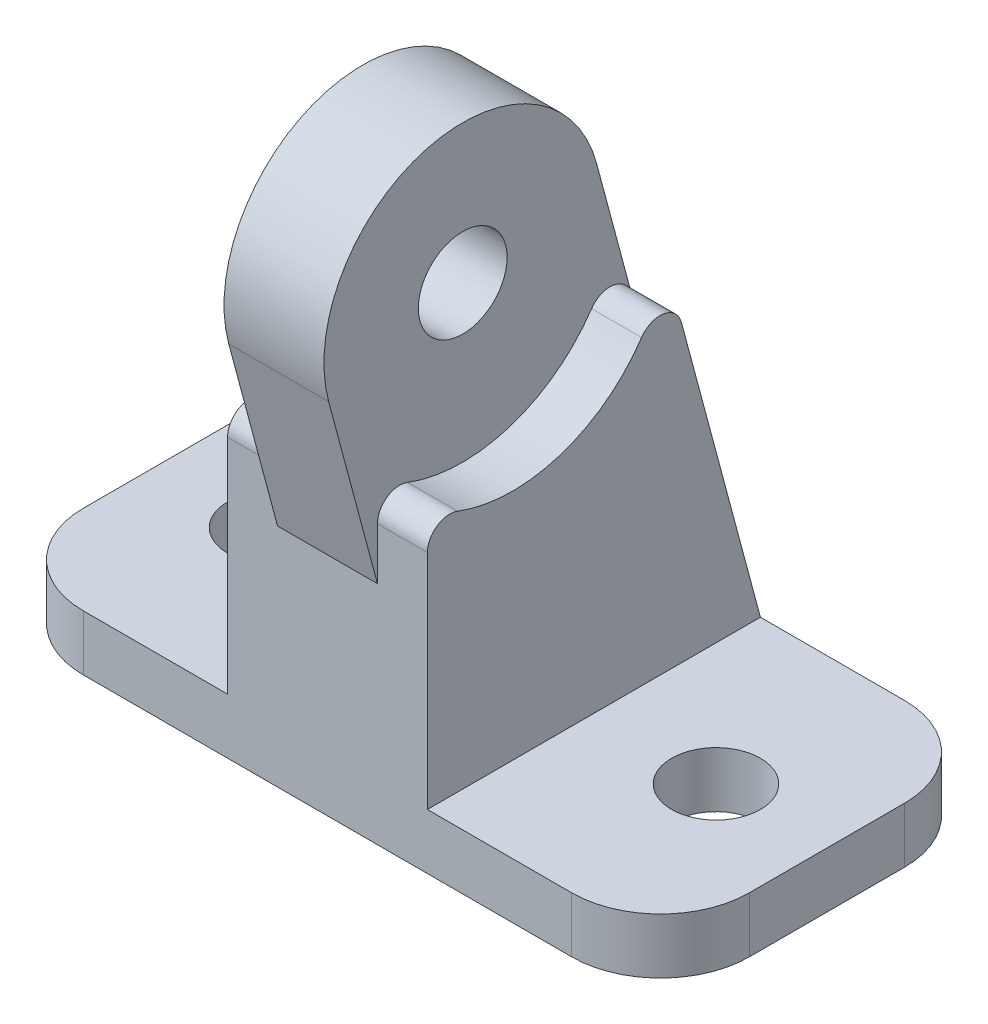
ISO-10303-21;
HEADER;
FILE_DESCRIPTION(('STEP AP214'),'2;1');
FILE_NAME('part.step','',(''),(''),'','','');
FILE_SCHEMA(('AUTOMOTIVE_DESIGN { 1 0 10303 214 1 1 1 1 }'));
ENDSEC;
DATA;
#1=APPLICATION_CONTEXT('core data for automotive mechanical design processes');
#2=APPLICATION_PROTOCOL_DEFINITION('international standard','automotive_design',2000,#1);
#3=PRODUCT_CONTEXT('',#1,'mechanical');
#4=PRODUCT('Part','Part','',(#3));
#5=PRODUCT_RELATED_PRODUCT_CATEGORY('part','',(#4));
#6=PRODUCT_DEFINITION_FORMATION('','',#4);
#7=PRODUCT_DEFINITION_CONTEXT('part definition',#1,'design');
#8=PRODUCT_DEFINITION('design','',#6,#7);
#9=PRODUCT_DEFINITION_SHAPE('','',#8);
#10=(LENGTH_UNIT() NAMED_UNIT(*) SI_UNIT(.MILLI.,.METRE.));
#11=(NAMED_UNIT(*) PLANE_ANGLE_UNIT() SI_UNIT($,.RADIAN.));
#12=(NAMED_UNIT(*) SI_UNIT($,.STERADIAN.) SOLID_ANGLE_UNIT());
#13=UNCERTAINTY_MEASURE_WITH_UNIT(LENGTH_MEASURE(1.E-05),#10,'distance_accuracy_value','');
#14=(GEOMETRIC_REPRESENTATION_CONTEXT(3) GLOBAL_UNCERTAINTY_ASSIGNED_CONTEXT((#13)) GLOBAL_UNIT_ASSIGNED_CONTEXT((#10,
#11,#12)) REPRESENTATION_CONTEXT('',''));
#15=CARTESIAN_POINT('',(0.,0.,0.));
#16=DIRECTION('',(0.,0.,1.));
#17=DIRECTION('',(1.,0.,0.));
#18=AXIS2_PLACEMENT_3D('',#15,#16,#17);
#19=CARTESIAN_POINT('',(-22.,5.,7.));
#20=DIRECTION('',(0.,-1.,0.));
#21=DIRECTION('',(0.,0.,-1.));
#22=AXIS2_PLACEMENT_3D('',#19,#20,#21);
#23=PLANE('',#22);
#24=CARTESIAN_POINT('',(-20.,5.,0.));
#25=DIRECTION('',(0.,1.,0.));
#26=DIRECTION('',(0.,0.,1.));
#27=AXIS2_PLACEMENT_3D('',#24,#25,#26);
#28=CIRCLE('',#27,4.);
#29=CARTESIAN_POINT('',(-20.,5.,4.));
#30=VERTEX_POINT('',#29);
#31=EDGE_CURVE('E253',#30,#30,#28,.T.);
#32=ORIENTED_EDGE('',*,*,#31,.F.);
#33=EDGE_LOOP('',(#32));
#34=FACE_BOUND('',#33,.T.);
#35=DIRECTION('',(0.,0.,-1.));
#36=VECTOR('',#35,1.);
#37=CARTESIAN_POINT('',(-9.,5.,0.));
#38=LINE('',#37,#36);
#39=CARTESIAN_POINT('',(-9.,5.,15.));
#40=VERTEX_POINT('',#39);
#41=CARTESIAN_POINT('',(-9.,5.,-15.));
#42=VERTEX_POINT('',#41);
#43=EDGE_CURVE('E383',#40,#42,#38,.T.);
#44=ORIENTED_EDGE('',*,*,#43,.T.);
#45=DIRECTION('',(-1.,0.,0.));
#46=VECTOR('',#45,1.);
#47=CARTESIAN_POINT('',(-21.9999999999999,5.,-15.));
#48=LINE('',#47,#46);
#49=CARTESIAN_POINT('',(-21.9999999999999,5.,-15.));
#50=VERTEX_POINT('',#49);
#51=EDGE_CURVE('E237',#42,#50,#48,.T.);
#52=ORIENTED_EDGE('',*,*,#51,.T.);
#53=CARTESIAN_POINT('',(-22.,5.,-7.));
#54=DIRECTION('',(0.,1.,0.));
#55=DIRECTION('',(0.,0.,-1.));
#56=AXIS2_PLACEMENT_3D('',#53,#54,#55);
#57=CIRCLE('',#56,8.);
#58=CARTESIAN_POINT('',(-30.,5.,-6.99999999999994));
#59=VERTEX_POINT('',#58);
#60=EDGE_CURVE('E240',#50,#59,#57,.T.);
#61=ORIENTED_EDGE('',*,*,#60,.T.);
#62=DIRECTION('',(0.,0.,1.));
#63=VECTOR('',#62,1.);
#64=CARTESIAN_POINT('',(-30.,5.,6.99999999999994));
#65=LINE('',#64,#63);
#66=CARTESIAN_POINT('',(-30.,5.,6.99999999999994));
#67=VERTEX_POINT('',#66);
#68=EDGE_CURVE('E244',#59,#67,#65,.T.);
#69=ORIENTED_EDGE('',*,*,#68,.T.);
#70=CARTESIAN_POINT('',(-22.,5.,7.));
#71=DIRECTION('',(0.,1.,0.));
#72=DIRECTION('',(0.,0.,-1.));
#73=AXIS2_PLACEMENT_3D('',#70,#71,#72);
#74=CIRCLE('',#73,8.);
#75=CARTESIAN_POINT('',(-21.9999999999999,5.,15.));
#76=VERTEX_POINT('',#75);
#77=EDGE_CURVE('E219',#67,#76,#74,.T.);
#78=ORIENTED_EDGE('',*,*,#77,.T.);
#79=DIRECTION('',(1.,0.,0.));
#80=VECTOR('',#79,1.);
#81=CARTESIAN_POINT('',(-21.9999999999999,5.,15.));
#82=LINE('',#81,#80);
#83=EDGE_CURVE('E218',#76,#40,#82,.T.);
#84=ORIENTED_EDGE('',*,*,#83,.T.);
#85=EDGE_LOOP('',(#44,#52,#61,#69,#78,#84));
#86=FACE_BOUND('',#85,.T.);
#87=ADVANCED_FACE('F45',(#34,#86),#23,.F.);
#88=CARTESIAN_POINT('',(20.,5.,0.));
#89=DIRECTION('',(0.,1.,0.));
#90=DIRECTION('',(0.,0.,-1.));
#91=AXIS2_PLACEMENT_3D('',#88,#89,#90);
#92=CIRCLE('',#91,4.);
#93=CARTESIAN_POINT('',(20.,5.,-4.));
#94=VERTEX_POINT('',#93);
#95=EDGE_CURVE('E431',#94,#94,#92,.T.);
#96=ORIENTED_EDGE('',*,*,#95,.F.);
#97=EDGE_LOOP('',(#96));
#98=FACE_BOUND('',#97,.T.);
#99=CARTESIAN_POINT('',(21.9999999999999,5.,-15.));
#100=VERTEX_POINT('',#99);
#101=CARTESIAN_POINT('',(9.,5.,-15.));
#102=VERTEX_POINT('',#101);
#103=EDGE_CURVE('E208',#100,#102,#48,.T.);
#104=ORIENTED_EDGE('',*,*,#103,.T.);
#105=DIRECTION('',(0.,0.,-1.));
#106=VECTOR('',#105,1.);
#107=CARTESIAN_POINT('',(9.,5.,0.));
#108=LINE('',#107,#106);
#109=CARTESIAN_POINT('',(9.,5.,15.));
#110=VERTEX_POINT('',#109);
#111=EDGE_CURVE('E192',#110,#102,#108,.T.);
#112=ORIENTED_EDGE('',*,*,#111,.F.);
#113=CARTESIAN_POINT('',(21.9999999999999,5.,15.));
#114=VERTEX_POINT('',#113);
#115=EDGE_CURVE('E205',#110,#114,#82,.T.);
#116=ORIENTED_EDGE('',*,*,#115,.T.);
#117=CARTESIAN_POINT('',(22.,5.,7.));
#118=DIRECTION('',(0.,1.,0.));
#119=DIRECTION('',(0.,0.,1.));
#120=AXIS2_PLACEMENT_3D('',#117,#118,#119);
#121=CIRCLE('',#120,8.);
#122=CARTESIAN_POINT('',(30.,5.,6.99999999999994));
#123=VERTEX_POINT('',#122);
#124=EDGE_CURVE('E223',#114,#123,#121,.T.);
#125=ORIENTED_EDGE('',*,*,#124,.T.);
#126=DIRECTION('',(0.,0.,-1.));
#127=VECTOR('',#126,1.);
#128=CARTESIAN_POINT('',(30.,5.,6.99999999999994));
#129=LINE('',#128,#127);
#130=CARTESIAN_POINT('',(30.,5.,-6.99999999999994));
#131=VERTEX_POINT('',#130);
#132=EDGE_CURVE('E231',#123,#131,#129,.T.);
#133=ORIENTED_EDGE('',*,*,#132,.T.);
#134=CARTESIAN_POINT('',(22.,5.,-7.));
#135=DIRECTION('',(0.,1.,0.));
#136=DIRECTION('',(0.,0.,-1.));
#137=AXIS2_PLACEMENT_3D('',#134,#135,#136);
#138=CIRCLE('',#137,8.);
#139=EDGE_CURVE('E234',#131,#100,#138,.T.);
#140=ORIENTED_EDGE('',*,*,#139,.T.);
#141=EDGE_LOOP('',(#104,#112,#116,#125,#133,#140));
#142=FACE_BOUND('',#141,.T.);
#143=ADVANCED_FACE('F204',(#98,#142),#23,.F.);
#144=CARTESIAN_POINT('',(-22.,0.,7.));
#145=DIRECTION('',(0.,-1.,0.));
#146=DIRECTION('',(0.,0.,-1.));
#147=AXIS2_PLACEMENT_3D('',#144,#145,#146);
#148=PLANE('',#147);
#149=CARTESIAN_POINT('',(-20.,0.,0.));
#150=DIRECTION('',(0.,1.,0.));
#151=DIRECTION('',(0.,0.,1.));
#152=AXIS2_PLACEMENT_3D('',#149,#150,#151);
#153=CIRCLE('',#152,4.);
#154=CARTESIAN_POINT('',(-20.,0.,4.));
#155=VERTEX_POINT('',#154);
#156=EDGE_CURVE('E435',#155,#155,#153,.T.);
#157=ORIENTED_EDGE('',*,*,#156,.T.);
#158=EDGE_LOOP('',(#157));
#159=FACE_BOUND('',#158,.T.);
#160=CARTESIAN_POINT('',(-22.,0.,7.));
#161=DIRECTION('',(0.,1.,0.));
#162=DIRECTION('',(0.,0.,-1.));
#163=AXIS2_PLACEMENT_3D('',#160,#161,#162);
#164=CIRCLE('',#163,8.);
#165=CARTESIAN_POINT('',(-30.,0.,6.99999999999994));
#166=VERTEX_POINT('',#165);
#167=CARTESIAN_POINT('',(-21.9999999999999,0.,15.));
#168=VERTEX_POINT('',#167);
#169=EDGE_CURVE('E248',#166,#168,#164,.T.);
#170=ORIENTED_EDGE('',*,*,#169,.F.);
#171=DIRECTION('',(0.,0.,1.));
#172=VECTOR('',#171,1.);
#173=CARTESIAN_POINT('',(-30.,0.,6.99999999999994));
#174=LINE('',#173,#172);
#175=CARTESIAN_POINT('',(-30.,0.,-6.99999999999994));
#176=VERTEX_POINT('',#175);
#177=EDGE_CURVE('E225',#176,#166,#174,.T.);
#178=ORIENTED_EDGE('',*,*,#177,.F.);
#179=CARTESIAN_POINT('',(-22.,0.,-7.));
#180=DIRECTION('',(0.,1.,0.));
#181=DIRECTION('',(0.,0.,-1.));
#182=AXIS2_PLACEMENT_3D('',#179,#180,#181);
#183=CIRCLE('',#182,8.);
#184=CARTESIAN_POINT('',(-21.9999999999999,0.,-15.));
#185=VERTEX_POINT('',#184);
#186=EDGE_CURVE('E268',#185,#176,#183,.T.);
#187=ORIENTED_EDGE('',*,*,#186,.F.);
#188=DIRECTION('',(-1.,0.,0.));
#189=VECTOR('',#188,1.);
#190=CARTESIAN_POINT('',(-21.9999999999999,0.,-15.));
#191=LINE('',#190,#189);
#192=CARTESIAN_POINT('',(21.9999999999999,0.,-15.));
#193=VERTEX_POINT('',#192);
#194=EDGE_CURVE('E265',#193,#185,#191,.T.);
#195=ORIENTED_EDGE('',*,*,#194,.F.);
#196=CARTESIAN_POINT('',(22.,0.,-7.));
#197=DIRECTION('',(0.,1.,0.));
#198=DIRECTION('',(0.,0.,-1.));
#199=AXIS2_PLACEMENT_3D('',#196,#197,#198);
#200=CIRCLE('',#199,8.);
#201=CARTESIAN_POINT('',(30.,0.,-6.99999999999994));
#202=VERTEX_POINT('',#201);
#203=EDGE_CURVE('E262',#202,#193,#200,.T.);
#204=ORIENTED_EDGE('',*,*,#203,.F.);
#205=DIRECTION('',(0.,0.,-1.));
#206=VECTOR('',#205,1.);
#207=CARTESIAN_POINT('',(30.,0.,6.99999999999994));
#208=LINE('',#207,#206);
#209=CARTESIAN_POINT('',(30.,0.,6.99999999999994));
#210=VERTEX_POINT('',#209);
#211=EDGE_CURVE('E259',#210,#202,#208,.T.);
#212=ORIENTED_EDGE('',*,*,#211,.F.);
#213=CARTESIAN_POINT('',(22.,0.,7.));
#214=DIRECTION('',(0.,1.,0.));
#215=DIRECTION('',(0.,0.,1.));
#216=AXIS2_PLACEMENT_3D('',#213,#214,#215);
#217=CIRCLE('',#216,8.);
#218=CARTESIAN_POINT('',(21.9999999999999,0.,15.));
#219=VERTEX_POINT('',#218);
#220=EDGE_CURVE('E256',#219,#210,#217,.T.);
#221=ORIENTED_EDGE('',*,*,#220,.F.);
#222=DIRECTION('',(1.,0.,0.));
#223=VECTOR('',#222,1.);
#224=CARTESIAN_POINT('',(-21.9999999999999,0.,15.));
#225=LINE('',#224,#223);
#226=EDGE_CURVE('E252',#168,#219,#225,.T.);
#227=ORIENTED_EDGE('',*,*,#226,.F.);
#228=EDGE_LOOP('',(#170,#178,#187,#195,#204,#212,#221,#227));
#229=FACE_BOUND('',#228,.T.);
#230=CARTESIAN_POINT('',(20.,0.,0.));
#231=DIRECTION('',(0.,1.,0.));
#232=DIRECTION('',(0.,0.,-1.));
#233=AXIS2_PLACEMENT_3D('',#230,#231,#232);
#234=CIRCLE('',#233,4.);
#235=CARTESIAN_POINT('',(20.,0.,-4.));
#236=VERTEX_POINT('',#235);
#237=EDGE_CURVE('E430',#236,#236,#234,.T.);
#238=ORIENTED_EDGE('',*,*,#237,.T.);
#239=EDGE_LOOP('',(#238));
#240=FACE_BOUND('',#239,.T.);
#241=ADVANCED_FACE('F445',(#159,#229,#240),#148,.T.);
#242=CARTESIAN_POINT('',(-22.,5.,7.));
#243=DIRECTION('',(0.,-1.,0.));
#244=DIRECTION('',(0.,0.,-1.));
#245=AXIS2_PLACEMENT_3D('',#242,#243,#244);
#246=CYLINDRICAL_SURFACE('',#245,8.);
#247=ORIENTED_EDGE('',*,*,#169,.T.);
#248=DIRECTION('',(0.,-1.,0.));
#249=VECTOR('',#248,1.);
#250=CARTESIAN_POINT('',(-21.9999999999999,5.,15.));
#251=LINE('',#250,#249);
#252=EDGE_CURVE('E298',#76,#168,#251,.T.);
#253=ORIENTED_EDGE('',*,*,#252,.F.);
#254=ORIENTED_EDGE('',*,*,#77,.F.);
#255=DIRECTION('',(0.,-1.,0.));
#256=VECTOR('',#255,1.);
#257=CARTESIAN_POINT('',(-30.,5.,6.99999999999994));
#258=LINE('',#257,#256);
#259=EDGE_CURVE('E247',#67,#166,#258,.T.);
#260=ORIENTED_EDGE('',*,*,#259,.T.);
#261=EDGE_LOOP('',(#247,#253,#254,#260));
#262=FACE_BOUND('',#261,.T.);
#263=ADVANCED_FACE('F474',(#262),#246,.T.);
#264=CARTESIAN_POINT('',(-21.9999999999999,5.,15.));
#265=DIRECTION('',(0.,0.,-1.));
#266=DIRECTION('',(-1.,0.,0.));
#267=AXIS2_PLACEMENT_3D('',#264,#265,#266);
#268=PLANE('',#267);
#269=DIRECTION('',(0.,-1.,0.));
#270=VECTOR('',#269,1.);
#271=CARTESIAN_POINT('',(-4.5,0.,15.));
#272=LINE('',#271,#270);
#273=CARTESIAN_POINT('',(-4.5,25.0424528800156,15.));
#274=VERTEX_POINT('',#273);
#275=CARTESIAN_POINT('',(-4.5,20.3689415981595,15.));
#276=VERTEX_POINT('',#275);
#277=EDGE_CURVE('E302',#274,#276,#272,.T.);
#278=ORIENTED_EDGE('',*,*,#277,.F.);
#279=DIRECTION('',(1.,0.,0.));
#280=VECTOR('',#279,1.);
#281=CARTESIAN_POINT('',(-9.,25.0424528800156,15.));
#282=LINE('',#281,#280);
#283=CARTESIAN_POINT('',(-9.,25.0424528800156,15.));
#284=VERTEX_POINT('',#283);
#285=EDGE_CURVE('E332',#274,#284,#282,.F.);
#286=ORIENTED_EDGE('',*,*,#285,.T.);
#287=DIRECTION('',(0.,1.,0.));
#288=VECTOR('',#287,1.);
#289=CARTESIAN_POINT('',(-9.,0.,15.));
#290=LINE('',#289,#288);
#291=EDGE_CURVE('E379',#40,#284,#290,.T.);
#292=ORIENTED_EDGE('',*,*,#291,.F.);
#293=ORIENTED_EDGE('',*,*,#83,.F.);
#294=ORIENTED_EDGE('',*,*,#252,.T.);
#295=ORIENTED_EDGE('',*,*,#226,.T.);
#296=DIRECTION('',(0.,-1.,0.));
#297=VECTOR('',#296,1.);
#298=CARTESIAN_POINT('',(21.9999999999999,5.,15.));
#299=LINE('',#298,#297);
#300=EDGE_CURVE('E215',#114,#219,#299,.T.);
#301=ORIENTED_EDGE('',*,*,#300,.F.);
#302=ORIENTED_EDGE('',*,*,#115,.F.);
#303=DIRECTION('',(0.,1.,0.));
#304=VECTOR('',#303,1.);
#305=CARTESIAN_POINT('',(9.,0.,15.));
#306=LINE('',#305,#304);
#307=CARTESIAN_POINT('',(9.,25.0424528800156,15.));
#308=VERTEX_POINT('',#307);
#309=EDGE_CURVE('E189',#110,#308,#306,.T.);
#310=ORIENTED_EDGE('',*,*,#309,.T.);
#311=DIRECTION('',(1.,0.,0.));
#312=VECTOR('',#311,1.);
#313=CARTESIAN_POINT('',(4.5,25.0424528800156,15.));
#314=LINE('',#313,#312);
#315=CARTESIAN_POINT('',(4.5,25.0424528800156,15.));
#316=VERTEX_POINT('',#315);
#317=EDGE_CURVE('E329',#308,#316,#314,.F.);
#318=ORIENTED_EDGE('',*,*,#317,.T.);
#319=DIRECTION('',(0.,-1.,0.));
#320=VECTOR('',#319,1.);
#321=CARTESIAN_POINT('',(4.5,0.,15.));
#322=LINE('',#321,#320);
#323=CARTESIAN_POINT('',(4.5,20.3689415981595,15.));
#324=VERTEX_POINT('',#323);
#325=EDGE_CURVE('E370',#316,#324,#322,.T.);
#326=ORIENTED_EDGE('',*,*,#325,.T.);
#327=DIRECTION('',(-1.,0.,0.));
#328=VECTOR('',#327,1.);
#329=CARTESIAN_POINT('',(4.5,20.3689415981595,15.));
#330=LINE('',#329,#328);
#331=EDGE_CURVE('E407',#324,#276,#330,.T.);
#332=ORIENTED_EDGE('',*,*,#331,.T.);
#333=EDGE_LOOP('',(#278,#286,#292,#293,#294,#295,#301,#302,#310,#318,#326,#332));
#334=FACE_BOUND('',#333,.T.);
#335=ADVANCED_FACE('F213',(#334),#268,.F.);
#336=CARTESIAN_POINT('',(22.,5.,7.));
#337=DIRECTION('',(0.,-1.,0.));
#338=DIRECTION('',(0.,0.,-1.));
#339=AXIS2_PLACEMENT_3D('',#336,#337,#338);
#340=CYLINDRICAL_SURFACE('',#339,8.);
#341=ORIENTED_EDGE('',*,*,#220,.T.);
#342=DIRECTION('',(0.,-1.,0.));
#343=VECTOR('',#342,1.);
#344=CARTESIAN_POINT('',(30.,5.,6.99999999999994));
#345=LINE('',#344,#343);
#346=EDGE_CURVE('E292',#123,#210,#345,.T.);
#347=ORIENTED_EDGE('',*,*,#346,.F.);
#348=ORIENTED_EDGE('',*,*,#124,.F.);
#349=ORIENTED_EDGE('',*,*,#300,.T.);
#350=EDGE_LOOP('',(#341,#347,#348,#349));
#351=FACE_BOUND('',#350,.T.);
#352=ADVANCED_FACE('F490',(#351),#340,.T.);
#353=CARTESIAN_POINT('',(30.,5.,6.99999999999994));
#354=DIRECTION('',(-1.,0.,0.));
#355=DIRECTION('',(0.,0.,1.));
#356=AXIS2_PLACEMENT_3D('',#353,#354,#355);
#357=PLANE('',#356);
#358=ORIENTED_EDGE('',*,*,#211,.T.);
#359=DIRECTION('',(0.,-1.,0.));
#360=VECTOR('',#359,1.);
#361=CARTESIAN_POINT('',(30.,5.,-6.99999999999994));
#362=LINE('',#361,#360);
#363=EDGE_CURVE('E288',#131,#202,#362,.T.);
#364=ORIENTED_EDGE('',*,*,#363,.F.);
#365=ORIENTED_EDGE('',*,*,#132,.F.);
#366=ORIENTED_EDGE('',*,*,#346,.T.);
#367=EDGE_LOOP('',(#358,#364,#365,#366));
#368=FACE_BOUND('',#367,.T.);
#369=ADVANCED_FACE('F486',(#368),#357,.F.);
#370=CARTESIAN_POINT('',(22.,5.,-7.));
#371=DIRECTION('',(0.,-1.,0.));
#372=DIRECTION('',(0.,0.,-1.));
#373=AXIS2_PLACEMENT_3D('',#370,#371,#372);
#374=CYLINDRICAL_SURFACE('',#373,8.);
#375=ORIENTED_EDGE('',*,*,#203,.T.);
#376=DIRECTION('',(0.,-1.,0.));
#377=VECTOR('',#376,1.);
#378=CARTESIAN_POINT('',(21.9999999999999,5.,-15.));
#379=LINE('',#378,#377);
#380=EDGE_CURVE('E284',#100,#193,#379,.T.);
#381=ORIENTED_EDGE('',*,*,#380,.F.);
#382=ORIENTED_EDGE('',*,*,#139,.F.);
#383=ORIENTED_EDGE('',*,*,#363,.T.);
#384=EDGE_LOOP('',(#375,#381,#382,#383));
#385=FACE_BOUND('',#384,.T.);
#386=ADVANCED_FACE('F482',(#385),#374,.T.);
#387=CARTESIAN_POINT('',(-21.9999999999999,5.,-15.));
#388=DIRECTION('',(0.,0.,1.));
#389=DIRECTION('',(1.,0.,0.));
#390=AXIS2_PLACEMENT_3D('',#387,#388,#389);
#391=PLANE('',#390);
#392=ORIENTED_EDGE('',*,*,#194,.T.);
#393=DIRECTION('',(0.,-1.,0.));
#394=VECTOR('',#393,1.);
#395=CARTESIAN_POINT('',(-21.9999999999999,5.,-15.));
#396=LINE('',#395,#394);
#397=EDGE_CURVE('E280',#50,#185,#396,.T.);
#398=ORIENTED_EDGE('',*,*,#397,.F.);
#399=ORIENTED_EDGE('',*,*,#51,.F.);
#400=EDGE_CURVE('E241',#102,#42,#48,.T.);
#401=ORIENTED_EDGE('',*,*,#400,.F.);
#402=ORIENTED_EDGE('',*,*,#103,.F.);
#403=ORIENTED_EDGE('',*,*,#380,.T.);
#404=EDGE_LOOP('',(#392,#398,#399,#401,#402,#403));
#405=FACE_BOUND('',#404,.T.);
#406=ADVANCED_FACE('F478',(#405),#391,.F.);
#407=CARTESIAN_POINT('',(-22.,5.,-7.));
#408=DIRECTION('',(0.,-1.,0.));
#409=DIRECTION('',(0.,0.,-1.));
#410=AXIS2_PLACEMENT_3D('',#407,#408,#409);
#411=CYLINDRICAL_SURFACE('',#410,8.);
#412=ORIENTED_EDGE('',*,*,#186,.T.);
#413=DIRECTION('',(0.,-1.,0.));
#414=VECTOR('',#413,1.);
#415=CARTESIAN_POINT('',(-30.,5.,-6.99999999999994));
#416=LINE('',#415,#414);
#417=EDGE_CURVE('E276',#59,#176,#416,.T.);
#418=ORIENTED_EDGE('',*,*,#417,.F.);
#419=ORIENTED_EDGE('',*,*,#60,.F.);
#420=ORIENTED_EDGE('',*,*,#397,.T.);
#421=EDGE_LOOP('',(#412,#418,#419,#420));
#422=FACE_BOUND('',#421,.T.);
#423=ADVANCED_FACE('F460',(#422),#411,.T.);
#424=CARTESIAN_POINT('',(-30.,5.,6.99999999999994));
#425=DIRECTION('',(1.,0.,0.));
#426=DIRECTION('',(0.,0.,-1.));
#427=AXIS2_PLACEMENT_3D('',#424,#425,#426);
#428=PLANE('',#427);
#429=ORIENTED_EDGE('',*,*,#177,.T.);
#430=ORIENTED_EDGE('',*,*,#259,.F.);
#431=ORIENTED_EDGE('',*,*,#68,.F.);
#432=ORIENTED_EDGE('',*,*,#417,.T.);
#433=EDGE_LOOP('',(#429,#430,#431,#432));
#434=FACE_BOUND('',#433,.T.);
#435=ADVANCED_FACE('F451',(#434),#428,.F.);
#436=CARTESIAN_POINT('',(-20.,5.,0.));
#437=DIRECTION('',(0.,-1.,0.));
#438=DIRECTION('',(0.,0.,-1.));
#439=AXIS2_PLACEMENT_3D('',#436,#437,#438);
#440=CYLINDRICAL_SURFACE('',#439,4.);
#441=ORIENTED_EDGE('',*,*,#31,.T.);
#442=EDGE_LOOP('',(#441));
#443=FACE_BOUND('',#442,.T.);
#444=ORIENTED_EDGE('',*,*,#156,.F.);
#445=EDGE_LOOP('',(#444));
#446=FACE_BOUND('',#445,.T.);
#447=ADVANCED_FACE('F448',(#443,#446),#440,.F.);
#448=CARTESIAN_POINT('',(20.,5.,0.));
#449=DIRECTION('',(0.,-1.,0.));
#450=DIRECTION('',(0.,0.,-1.));
#451=AXIS2_PLACEMENT_3D('',#448,#449,#450);
#452=CYLINDRICAL_SURFACE('',#451,4.);
#453=ORIENTED_EDGE('',*,*,#95,.T.);
#454=EDGE_LOOP('',(#453));
#455=FACE_BOUND('',#454,.T.);
#456=ORIENTED_EDGE('',*,*,#237,.F.);
#457=EDGE_LOOP('',(#456));
#458=FACE_BOUND('',#457,.T.);
#459=ADVANCED_FACE('F450',(#455,#458),#452,.F.);
#460=CARTESIAN_POINT('',(4.5,4.08493649053892,-15.2451905283833));
#461=DIRECTION('',(0.,0.258819045102522,-0.965925826289068));
#462=DIRECTION('',(0.,0.965925826289068,0.258819045102522));
#463=AXIS2_PLACEMENT_3D('',#460,#461,#462);
#464=PLANE('',#463);
#465=DIRECTION('',(0.,-0.965925826289068,-0.258819045102522));
#466=VECTOR('',#465,1.);
#467=CARTESIAN_POINT('',(-9.,4.08493649053892,-15.2451905283833));
#468=LINE('',#467,#466);
#469=CARTESIAN_POINT('',(-9.,31.5739087527299,-7.87954260996765));
#470=VERTEX_POINT('',#469);
#471=EDGE_CURVE('E387',#470,#42,#468,.T.);
#472=ORIENTED_EDGE('',*,*,#471,.F.);
#473=DIRECTION('',(-1.,0.,0.));
#474=VECTOR('',#473,1.);
#475=CARTESIAN_POINT('',(4.5,31.5739087527299,-7.87954260996765));
#476=LINE('',#475,#474);
#477=CARTESIAN_POINT('',(-4.5,31.5739087527299,-7.87954260996765));
#478=VERTEX_POINT('',#477);
#479=EDGE_CURVE('E325',#470,#478,#476,.F.);
#480=ORIENTED_EDGE('',*,*,#479,.T.);
#481=DIRECTION('',(0.,-0.965925826289068,-0.258819045102522));
#482=VECTOR('',#481,1.);
#483=CARTESIAN_POINT('',(-4.5,4.08493649053892,-15.2451905283833));
#484=LINE('',#483,#482);
#485=CARTESIAN_POINT('',(-4.5,43.2352380637815,-4.75489883839797));
#486=VERTEX_POINT('',#485);
#487=EDGE_CURVE('E392',#486,#478,#484,.T.);
#488=ORIENTED_EDGE('',*,*,#487,.F.);
#489=DIRECTION('',(-1.,0.,0.));
#490=VECTOR('',#489,1.);
#491=CARTESIAN_POINT('',(4.5,43.2352380637815,-4.75489883839797));
#492=LINE('',#491,#490);
#493=CARTESIAN_POINT('',(4.5,43.2352380637815,-4.75489883839797));
#494=VERTEX_POINT('',#493);
#495=EDGE_CURVE('E427',#494,#486,#492,.T.);
#496=ORIENTED_EDGE('',*,*,#495,.F.);
#497=DIRECTION('',(0.,-0.965925826289068,-0.258819045102522));
#498=VECTOR('',#497,1.);
#499=CARTESIAN_POINT('',(4.5,4.08493649053892,-15.2451905283833));
#500=LINE('',#499,#498);
#501=CARTESIAN_POINT('',(4.5,31.5739087527299,-7.87954260996765));
#502=VERTEX_POINT('',#501);
#503=EDGE_CURVE('E359',#494,#502,#500,.T.);
#504=ORIENTED_EDGE('',*,*,#503,.T.);
#505=DIRECTION('',(-1.,0.,0.));
#506=VECTOR('',#505,1.);
#507=CARTESIAN_POINT('',(4.5,31.5739087527299,-7.87954260996765));
#508=LINE('',#507,#506);
#509=CARTESIAN_POINT('',(9.,31.5739087527299,-7.87954260996765));
#510=VERTEX_POINT('',#509);
#511=EDGE_CURVE('E322',#502,#510,#508,.F.);
#512=ORIENTED_EDGE('',*,*,#511,.T.);
#513=DIRECTION('',(0.,-0.965925826289068,-0.258819045102522));
#514=VECTOR('',#513,1.);
#515=CARTESIAN_POINT('',(9.,4.08493649053892,-15.2451905283833));
#516=LINE('',#515,#514);
#517=EDGE_CURVE('E210',#510,#102,#516,.T.);
#518=ORIENTED_EDGE('',*,*,#517,.T.);
#519=ORIENTED_EDGE('',*,*,#400,.T.);
#520=EDGE_LOOP('',(#472,#480,#488,#496,#504,#512,#518,#519));
#521=FACE_BOUND('',#520,.T.);
#522=ADVANCED_FACE('F366',(#521),#464,.T.);
#523=CARTESIAN_POINT('',(4.5,40.,7.31917399021537));
#524=DIRECTION('',(-1.,0.,0.));
#525=DIRECTION('',(0.,0.,1.));
#526=AXIS2_PLACEMENT_3D('',#523,#524,#525);
#527=CYLINDRICAL_SURFACE('',#526,12.5);
#528=CARTESIAN_POINT('',(-4.5,40.,7.31917399021537));
#529=DIRECTION('',(1.,0.,0.));
#530=DIRECTION('',(0.,0.,-1.));
#531=AXIS2_PLACEMENT_3D('',#528,#529,#530);
#532=CIRCLE('',#531,12.5);
#533=CARTESIAN_POINT('',(-4.5,36.7647619362185,19.3932468188287));
#534=VERTEX_POINT('',#533);
#535=EDGE_CURVE('E410',#486,#534,#532,.T.);
#536=ORIENTED_EDGE('',*,*,#535,.T.);
#537=DIRECTION('',(-1.,0.,0.));
#538=VECTOR('',#537,1.);
#539=CARTESIAN_POINT('',(4.5,36.7647619362185,19.3932468188287));
#540=LINE('',#539,#538);
#541=CARTESIAN_POINT('',(4.5,36.7647619362185,19.3932468188287));
#542=VERTEX_POINT('',#541);
#543=EDGE_CURVE('E423',#542,#534,#540,.T.);
#544=ORIENTED_EDGE('',*,*,#543,.F.);
#545=CARTESIAN_POINT('',(4.5,40.,7.31917399021537));
#546=DIRECTION('',(1.,0.,0.));
#547=DIRECTION('',(0.,0.,-1.));
#548=AXIS2_PLACEMENT_3D('',#545,#546,#547);
#549=CIRCLE('',#548,12.5);
#550=EDGE_CURVE('E395',#494,#542,#549,.T.);
#551=ORIENTED_EDGE('',*,*,#550,.F.);
#552=ORIENTED_EDGE('',*,*,#495,.T.);
#553=EDGE_LOOP('',(#536,#544,#551,#552));
#554=FACE_BOUND('',#553,.T.);
#555=ADVANCED_FACE('F567',(#554),#527,.T.);
#556=CARTESIAN_POINT('',(4.5,-2.38553963702412,8.90295512884337));
#557=DIRECTION('',(0.,0.258819045102523,-0.965925826289068));
#558=DIRECTION('',(0.,0.965925826289068,0.258819045102523));
#559=AXIS2_PLACEMENT_3D('',#556,#557,#558);
#560=PLANE('',#559);
#561=DIRECTION('',(0.,-0.965925826289068,-0.258819045102523));
#562=VECTOR('',#561,1.);
#563=CARTESIAN_POINT('',(-4.5,-2.38553963702412,8.90295512884337));
#564=LINE('',#563,#562);
#565=EDGE_CURVE('E413',#534,#276,#564,.T.);
#566=ORIENTED_EDGE('',*,*,#565,.T.);
#567=ORIENTED_EDGE('',*,*,#331,.F.);
#568=DIRECTION('',(0.,-0.965925826289068,-0.258819045102523));
#569=VECTOR('',#568,1.);
#570=CARTESIAN_POINT('',(4.5,-2.38553963702412,8.90295512884337));
#571=LINE('',#570,#569);
#572=EDGE_CURVE('E399',#542,#324,#571,.T.);
#573=ORIENTED_EDGE('',*,*,#572,.F.);
#574=ORIENTED_EDGE('',*,*,#543,.T.);
#575=EDGE_LOOP('',(#566,#567,#573,#574));
#576=FACE_BOUND('',#575,.T.);
#577=ADVANCED_FACE('F520',(#576),#560,.F.);
#578=CARTESIAN_POINT('',(4.5,40.,7.31917399021537));
#579=DIRECTION('',(-1.,0.,0.));
#580=DIRECTION('',(0.,0.,1.));
#581=AXIS2_PLACEMENT_3D('',#578,#579,#580);
#582=CYLINDRICAL_SURFACE('',#581,4.);
#583=CARTESIAN_POINT('',(4.5,40.,7.31917399021537));
#584=DIRECTION('',(1.,0.,0.));
#585=DIRECTION('',(0.,0.,-1.));
#586=AXIS2_PLACEMENT_3D('',#583,#584,#585);
#587=CIRCLE('',#586,4.);
#588=CARTESIAN_POINT('',(4.5,40.,3.31917399021537));
#589=VERTEX_POINT('',#588);
#590=EDGE_CURVE('E403',#589,#589,#587,.T.);
#591=ORIENTED_EDGE('',*,*,#590,.T.);
#592=EDGE_LOOP('',(#591));
#593=FACE_BOUND('',#592,.T.);
#594=CARTESIAN_POINT('',(-4.5,40.,7.31917399021537));
#595=DIRECTION('',(1.,0.,0.));
#596=DIRECTION('',(0.,0.,-1.));
#597=AXIS2_PLACEMENT_3D('',#594,#595,#596);
#598=CIRCLE('',#597,4.);
#599=CARTESIAN_POINT('',(-4.5,40.,3.31917399021537));
#600=VERTEX_POINT('',#599);
#601=EDGE_CURVE('E396',#600,#600,#598,.T.);
#602=ORIENTED_EDGE('',*,*,#601,.F.);
#603=EDGE_LOOP('',(#602));
#604=FACE_BOUND('',#603,.T.);
#605=ADVANCED_FACE('F574',(#593,#604),#582,.F.);
#606=CARTESIAN_POINT('',(4.5,0.,0.));
#607=DIRECTION('',(1.,0.,0.));
#608=DIRECTION('',(0.,0.,-1.));
#609=AXIS2_PLACEMENT_3D('',#606,#607,#608);
#610=PLANE('',#609);
#611=CARTESIAN_POINT('',(4.5,40.,7.31917399021537));
#612=DIRECTION('',(1.,0.,0.));
#613=DIRECTION('',(0.,0.,-1.));
#614=AXIS2_PLACEMENT_3D('',#611,#612,#613);
#615=CIRCLE('',#614,14.);
#616=CARTESIAN_POINT('',(4.5,32.1742368297093,-4.2893328389389));
#617=VERTEX_POINT('',#616);
#618=CARTESIAN_POINT('',(4.5,26.9121462700136,12.2898967487769));
#619=VERTEX_POINT('',#618);
#620=EDGE_CURVE('E360',#617,#619,#615,.F.);
#621=ORIENTED_EDGE('',*,*,#620,.F.);
#622=CARTESIAN_POINT('',(4.5,31.0562706625249,-5.94769095738951));
#623=DIRECTION('',(1.,0.,0.));
#624=DIRECTION('',(0.,0.,-1.));
#625=AXIS2_PLACEMENT_3D('',#622,#623,#624);
#626=CIRCLE('',#625,2.);
#627=EDGE_CURVE('E54',#617,#502,#626,.F.);
#628=ORIENTED_EDGE('',*,*,#627,.T.);
#629=ORIENTED_EDGE('',*,*,#503,.F.);
#630=ORIENTED_EDGE('',*,*,#550,.T.);
#631=ORIENTED_EDGE('',*,*,#572,.T.);
#632=ORIENTED_EDGE('',*,*,#325,.F.);
#633=CARTESIAN_POINT('',(4.5,25.0424528800156,13.));
#634=DIRECTION('',(1.,0.,0.));
#635=DIRECTION('',(0.,0.,-1.));
#636=AXIS2_PLACEMENT_3D('',#633,#634,#635);
#637=CIRCLE('',#636,2.);
#638=EDGE_CURVE('E11',#316,#619,#637,.F.);
#639=ORIENTED_EDGE('',*,*,#638,.T.);
#640=EDGE_LOOP('',(#621,#628,#629,#630,#631,#632,#639));
#641=FACE_BOUND('',#640,.T.);
#642=ORIENTED_EDGE('',*,*,#590,.F.);
#643=EDGE_LOOP('',(#642));
#644=FACE_BOUND('',#643,.T.);
#645=ADVANCED_FACE('F357',(#641,#644),#610,.T.);
#646=CARTESIAN_POINT('',(-4.5,0.,0.));
#647=DIRECTION('',(1.,0.,0.));
#648=DIRECTION('',(0.,0.,-1.));
#649=AXIS2_PLACEMENT_3D('',#646,#647,#648);
#650=PLANE('',#649);
#651=ORIENTED_EDGE('',*,*,#487,.T.);
#652=CARTESIAN_POINT('',(-4.5,31.0562706625249,-5.94769095738951));
#653=DIRECTION('',(1.,0.,0.));
#654=DIRECTION('',(0.,0.,-1.));
#655=AXIS2_PLACEMENT_3D('',#652,#653,#654);
#656=CIRCLE('',#655,2.);
#657=CARTESIAN_POINT('',(-4.5,32.1742368297093,-4.2893328389389));
#658=VERTEX_POINT('',#657);
#659=EDGE_CURVE('E346',#478,#658,#656,.T.);
#660=ORIENTED_EDGE('',*,*,#659,.T.);
#661=CARTESIAN_POINT('',(-4.5,40.,7.31917399021537));
#662=DIRECTION('',(1.,0.,0.));
#663=DIRECTION('',(0.,0.,-1.));
#664=AXIS2_PLACEMENT_3D('',#661,#662,#663);
#665=CIRCLE('',#664,14.);
#666=CARTESIAN_POINT('',(-4.5,26.9121462700136,12.2898967487769));
#667=VERTEX_POINT('',#666);
#668=EDGE_CURVE('E305',#658,#667,#665,.F.);
#669=ORIENTED_EDGE('',*,*,#668,.T.);
#670=CARTESIAN_POINT('',(-4.5,25.0424528800156,13.));
#671=DIRECTION('',(1.,0.,0.));
#672=DIRECTION('',(0.,0.,-1.));
#673=AXIS2_PLACEMENT_3D('',#670,#671,#672);
#674=CIRCLE('',#673,2.);
#675=EDGE_CURVE('E349',#667,#274,#674,.T.);
#676=ORIENTED_EDGE('',*,*,#675,.T.);
#677=ORIENTED_EDGE('',*,*,#277,.T.);
#678=ORIENTED_EDGE('',*,*,#565,.F.);
#679=ORIENTED_EDGE('',*,*,#535,.F.);
#680=EDGE_LOOP('',(#651,#660,#669,#676,#677,#678,#679));
#681=FACE_BOUND('',#680,.T.);
#682=ORIENTED_EDGE('',*,*,#601,.T.);
#683=EDGE_LOOP('',(#682));
#684=FACE_BOUND('',#683,.T.);
#685=ADVANCED_FACE('F564',(#681,#684),#650,.F.);
#686=CARTESIAN_POINT('',(9.,40.,7.31917399021537));
#687=DIRECTION('',(-1.,0.,0.));
#688=DIRECTION('',(0.,0.,1.));
#689=AXIS2_PLACEMENT_3D('',#686,#687,#688);
#690=CYLINDRICAL_SURFACE('',#689,14.);
#691=ORIENTED_EDGE('',*,*,#668,.F.);
#692=DIRECTION('',(-1.,0.,0.));
#693=VECTOR('',#692,1.);
#694=CARTESIAN_POINT('',(9.,32.1742368297093,-4.28933283893891));
#695=LINE('',#694,#693);
#696=CARTESIAN_POINT('',(-9.,32.1742368297093,-4.2893328389389));
#697=VERTEX_POINT('',#696);
#698=EDGE_CURVE('E312',#658,#697,#695,.T.);
#699=ORIENTED_EDGE('',*,*,#698,.T.);
#700=CARTESIAN_POINT('',(-9.,40.,7.31917399021537));
#701=DIRECTION('',(1.,0.,0.));
#702=DIRECTION('',(0.,0.,-1.));
#703=AXIS2_PLACEMENT_3D('',#700,#701,#702);
#704=CIRCLE('',#703,14.);
#705=CARTESIAN_POINT('',(-9.,26.9121462700136,12.2898967487769));
#706=VERTEX_POINT('',#705);
#707=EDGE_CURVE('E375',#706,#697,#704,.T.);
#708=ORIENTED_EDGE('',*,*,#707,.F.);
#709=DIRECTION('',(-1.,0.,0.));
#710=VECTOR('',#709,1.);
#711=CARTESIAN_POINT('',(9.,26.9121462700136,12.2898967487769));
#712=LINE('',#711,#710);
#713=EDGE_CURVE('E309',#706,#667,#712,.F.);
#714=ORIENTED_EDGE('',*,*,#713,.T.);
#715=EDGE_LOOP('',(#691,#699,#708,#714));
#716=FACE_BOUND('',#715,.T.);
#717=ADVANCED_FACE('F533',(#716),#690,.F.);
#718=CARTESIAN_POINT('',(-9.,0.,0.));
#719=DIRECTION('',(1.,0.,0.));
#720=DIRECTION('',(0.,0.,-1.));
#721=AXIS2_PLACEMENT_3D('',#718,#719,#720);
#722=PLANE('',#721);
#723=ORIENTED_EDGE('',*,*,#707,.T.);
#724=CARTESIAN_POINT('',(-9.,31.0562706625249,-5.94769095738951));
#725=DIRECTION('',(1.,0.,0.));
#726=DIRECTION('',(0.,0.,-1.));
#727=AXIS2_PLACEMENT_3D('',#724,#725,#726);
#728=CIRCLE('',#727,2.);
#729=EDGE_CURVE('E319',#697,#470,#728,.F.);
#730=ORIENTED_EDGE('',*,*,#729,.T.);
#731=ORIENTED_EDGE('',*,*,#471,.T.);
#732=ORIENTED_EDGE('',*,*,#43,.F.);
#733=ORIENTED_EDGE('',*,*,#291,.T.);
#734=CARTESIAN_POINT('',(-9.,25.0424528800156,13.));
#735=DIRECTION('',(1.,0.,0.));
#736=DIRECTION('',(0.,0.,-1.));
#737=AXIS2_PLACEMENT_3D('',#734,#735,#736);
#738=CIRCLE('',#737,2.);
#739=EDGE_CURVE('E316',#284,#706,#738,.F.);
#740=ORIENTED_EDGE('',*,*,#739,.T.);
#741=EDGE_LOOP('',(#723,#730,#731,#732,#733,#740));
#742=FACE_BOUND('',#741,.T.);
#743=ADVANCED_FACE('F529',(#742),#722,.F.);
#744=CARTESIAN_POINT('',(9.,40.,7.31917399021537));
#745=DIRECTION('',(1.,0.,0.));
#746=DIRECTION('',(0.,0.,-1.));
#747=AXIS2_PLACEMENT_3D('',#744,#745,#746);
#748=CIRCLE('',#747,14.);
#749=CARTESIAN_POINT('',(9.,26.9121462700136,12.2898967487769));
#750=VERTEX_POINT('',#749);
#751=CARTESIAN_POINT('',(9.,32.1742368297093,-4.2893328389389));
#752=VERTEX_POINT('',#751);
#753=EDGE_CURVE('E201',#750,#752,#748,.T.);
#754=ORIENTED_EDGE('',*,*,#753,.T.);
#755=DIRECTION('',(-1.,0.,0.));
#756=VECTOR('',#755,1.);
#757=CARTESIAN_POINT('',(9.,32.1742368297093,-4.28933283893891));
#758=LINE('',#757,#756);
#759=EDGE_CURVE('E338',#752,#617,#758,.T.);
#760=ORIENTED_EDGE('',*,*,#759,.T.);
#761=ORIENTED_EDGE('',*,*,#620,.T.);
#762=DIRECTION('',(-1.,0.,0.));
#763=VECTOR('',#762,1.);
#764=CARTESIAN_POINT('',(9.,26.9121462700136,12.2898967487769));
#765=LINE('',#764,#763);
#766=EDGE_CURVE('E68',#619,#750,#765,.F.);
#767=ORIENTED_EDGE('',*,*,#766,.T.);
#768=EDGE_LOOP('',(#754,#760,#761,#767));
#769=FACE_BOUND('',#768,.T.);
#770=ADVANCED_FACE('F585',(#769),#690,.F.);
#771=CARTESIAN_POINT('',(9.,0.,0.));
#772=DIRECTION('',(1.,0.,0.));
#773=DIRECTION('',(0.,0.,-1.));
#774=AXIS2_PLACEMENT_3D('',#771,#772,#773);
#775=PLANE('',#774);
#776=ORIENTED_EDGE('',*,*,#517,.F.);
#777=CARTESIAN_POINT('',(9.,31.0562706625249,-5.94769095738951));
#778=DIRECTION('',(1.,0.,0.));
#779=DIRECTION('',(0.,0.,-1.));
#780=AXIS2_PLACEMENT_3D('',#777,#778,#779);
#781=CIRCLE('',#780,2.);
#782=EDGE_CURVE('E61',#510,#752,#781,.T.);
#783=ORIENTED_EDGE('',*,*,#782,.T.);
#784=ORIENTED_EDGE('',*,*,#753,.F.);
#785=CARTESIAN_POINT('',(9.,25.0424528800156,13.));
#786=DIRECTION('',(1.,0.,0.));
#787=DIRECTION('',(0.,0.,-1.));
#788=AXIS2_PLACEMENT_3D('',#785,#786,#787);
#789=CIRCLE('',#788,2.);
#790=EDGE_CURVE('E195',#750,#308,#789,.T.);
#791=ORIENTED_EDGE('',*,*,#790,.T.);
#792=ORIENTED_EDGE('',*,*,#309,.F.);
#793=ORIENTED_EDGE('',*,*,#111,.T.);
#794=EDGE_LOOP('',(#776,#783,#784,#791,#792,#793));
#795=FACE_BOUND('',#794,.T.);
#796=ADVANCED_FACE('F191',(#795),#775,.T.);
#797=CARTESIAN_POINT('',(9.,31.0562706625249,-5.94769095738951));
#798=DIRECTION('',(-1.,0.,0.));
#799=DIRECTION('',(0.,0.,1.));
#800=AXIS2_PLACEMENT_3D('',#797,#798,#799);
#801=CYLINDRICAL_SURFACE('',#800,2.);
#802=ORIENTED_EDGE('',*,*,#659,.F.);
#803=ORIENTED_EDGE('',*,*,#479,.F.);
#804=ORIENTED_EDGE('',*,*,#729,.F.);
#805=ORIENTED_EDGE('',*,*,#698,.F.);
#806=EDGE_LOOP('',(#802,#803,#804,#805));
#807=FACE_BOUND('',#806,.T.);
#808=ADVANCED_FACE('F500',(#807),#801,.T.);
#809=CARTESIAN_POINT('',(9.,25.0424528800156,13.));
#810=DIRECTION('',(-1.,0.,0.));
#811=DIRECTION('',(0.,0.,1.));
#812=AXIS2_PLACEMENT_3D('',#809,#810,#811);
#813=CYLINDRICAL_SURFACE('',#812,2.);
#814=ORIENTED_EDGE('',*,*,#675,.F.);
#815=ORIENTED_EDGE('',*,*,#713,.F.);
#816=ORIENTED_EDGE('',*,*,#739,.F.);
#817=ORIENTED_EDGE('',*,*,#285,.F.);
#818=EDGE_LOOP('',(#814,#815,#816,#817));
#819=FACE_BOUND('',#818,.T.);
#820=ADVANCED_FACE('F503',(#819),#813,.T.);
#821=CARTESIAN_POINT('',(9.,31.0562706625249,-5.94769095738951));
#822=DIRECTION('',(-1.,0.,0.));
#823=DIRECTION('',(0.,0.,1.));
#824=AXIS2_PLACEMENT_3D('',#821,#822,#823);
#825=CYLINDRICAL_SURFACE('',#824,2.);
#826=ORIENTED_EDGE('',*,*,#782,.F.);
#827=ORIENTED_EDGE('',*,*,#511,.F.);
#828=ORIENTED_EDGE('',*,*,#627,.F.);
#829=ORIENTED_EDGE('',*,*,#759,.F.);
#830=EDGE_LOOP('',(#826,#827,#828,#829));
#831=FACE_BOUND('',#830,.T.);
#832=ADVANCED_FACE('F363',(#831),#825,.T.);
#833=CARTESIAN_POINT('',(9.,25.0424528800156,13.));
#834=DIRECTION('',(-1.,0.,0.));
#835=DIRECTION('',(0.,0.,1.));
#836=AXIS2_PLACEMENT_3D('',#833,#834,#835);
#837=CYLINDRICAL_SURFACE('',#836,2.);
#838=ORIENTED_EDGE('',*,*,#790,.F.);
#839=ORIENTED_EDGE('',*,*,#766,.F.);
#840=ORIENTED_EDGE('',*,*,#638,.F.);
#841=ORIENTED_EDGE('',*,*,#317,.F.);
#842=EDGE_LOOP('',(#838,#839,#840,#841));
#843=FACE_BOUND('',#842,.T.);
#844=ADVANCED_FACE('F47',(#843),#837,.T.);
#845=CLOSED_SHELL('',(#87,#143,#241,#263,#335,#352,#369,#386,#406,#423,#435,#447,#459,#522,#555,
#577,#605,#645,#685,#717,#743,#770,#796,#808,#820,#832,#844));
#846=MANIFOLD_SOLID_BREP('B2',#845);
#847=ADVANCED_BREP_SHAPE_REPRESENTATION('',(#18,#846),#14);
#848=SHAPE_DEFINITION_REPRESENTATION(#9,#847);
ENDSEC;
END-ISO-10303-21;
